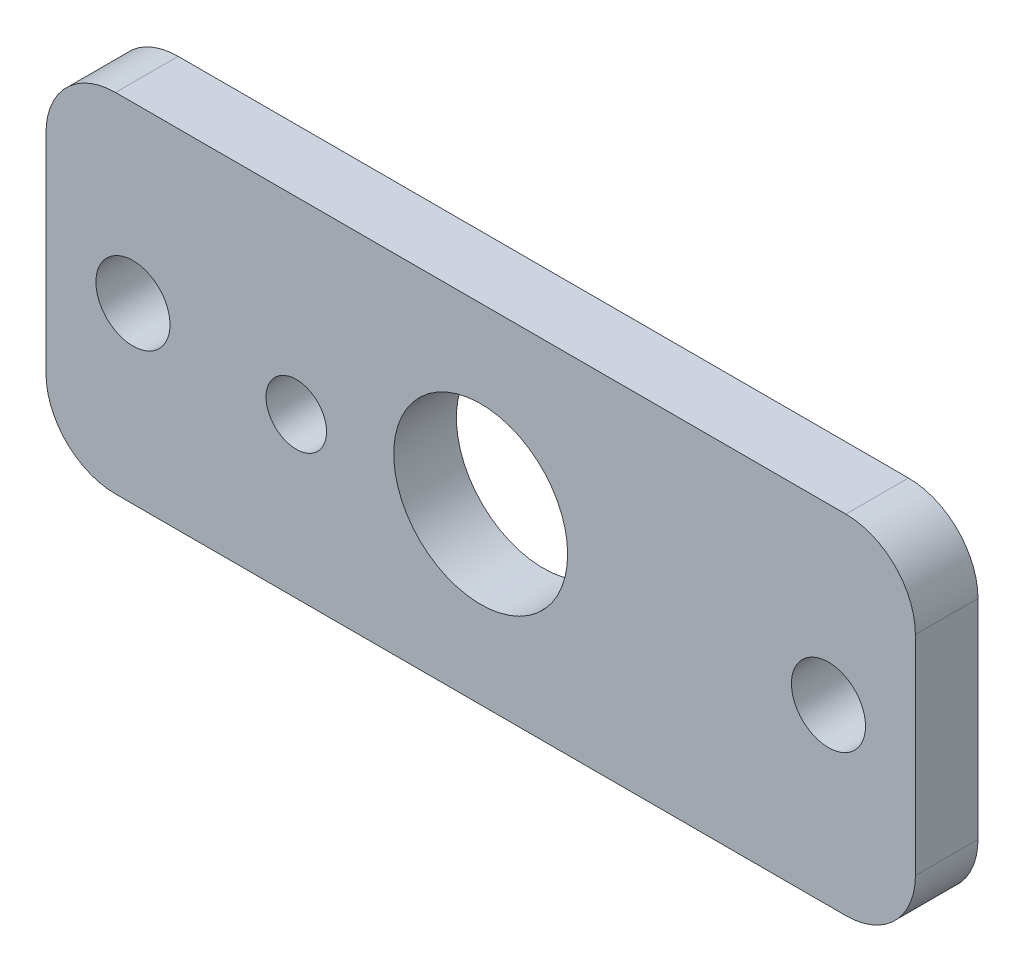
ISO-10303-21;
HEADER;
FILE_DESCRIPTION(('STEP AP214'),'2;1');
FILE_NAME('part.step','',(''),(''),'','','');
FILE_SCHEMA(('AUTOMOTIVE_DESIGN { 1 0 10303 214 1 1 1 1 }'));
ENDSEC;
DATA;
#1=APPLICATION_CONTEXT('core data for automotive mechanical design processes');
#2=APPLICATION_PROTOCOL_DEFINITION('international standard','automotive_design',2000,#1);
#3=PRODUCT_CONTEXT('',#1,'mechanical');
#4=PRODUCT('Part','Part','',(#3));
#5=PRODUCT_RELATED_PRODUCT_CATEGORY('part','',(#4));
#6=PRODUCT_DEFINITION_FORMATION('','',#4);
#7=PRODUCT_DEFINITION_CONTEXT('part definition',#1,'design');
#8=PRODUCT_DEFINITION('design','',#6,#7);
#9=PRODUCT_DEFINITION_SHAPE('','',#8);
#10=(LENGTH_UNIT() NAMED_UNIT(*) SI_UNIT(.MILLI.,.METRE.));
#11=(NAMED_UNIT(*) PLANE_ANGLE_UNIT() SI_UNIT($,.RADIAN.));
#12=(NAMED_UNIT(*) SI_UNIT($,.STERADIAN.) SOLID_ANGLE_UNIT());
#13=UNCERTAINTY_MEASURE_WITH_UNIT(LENGTH_MEASURE(1.E-05),#10,'distance_accuracy_value','');
#14=(GEOMETRIC_REPRESENTATION_CONTEXT(3) GLOBAL_UNCERTAINTY_ASSIGNED_CONTEXT((#13)) GLOBAL_UNIT_ASSIGNED_CONTEXT((#10,
#11,#12)) REPRESENTATION_CONTEXT('',''));
#15=CARTESIAN_POINT('',(0.,0.,0.));
#16=DIRECTION('',(0.,0.,1.));
#17=DIRECTION('',(1.,0.,0.));
#18=AXIS2_PLACEMENT_3D('',#15,#16,#17);
#19=CARTESIAN_POINT('',(15.8749998125921,-172.466000205086,2.2859999999977));
#20=DIRECTION('',(-1.,0.,0.));
#21=DIRECTION('',(0.,0.,1.));
#22=AXIS2_PLACEMENT_3D('',#19,#20,#21);
#23=PLANE('',#22);
#24=DIRECTION('',(0.,1.,0.));
#25=VECTOR('',#24,1.);
#26=CARTESIAN_POINT('',(15.8749998125921,-172.466000205086,2.2859999999977));
#27=LINE('',#26,#25);
#28=CARTESIAN_POINT('',(15.8749998125921,-169.926000205086,2.28599999999774));
#29=VERTEX_POINT('',#28);
#30=CARTESIAN_POINT('',(15.8749998125921,-162.306000205086,2.28599999999785));
#31=VERTEX_POINT('',#30);
#32=EDGE_CURVE('E122',#29,#31,#27,.T.);
#33=ORIENTED_EDGE('',*,*,#32,.F.);
#34=DIRECTION('',(0.,0.,-1.));
#35=VECTOR('',#34,1.);
#36=CARTESIAN_POINT('',(15.8749998125921,-169.926000205086,2.28599999999774));
#37=LINE('',#36,#35);
#38=CARTESIAN_POINT('',(15.8749998125921,-169.926000205086,-2.26034468919778E-12));
#39=VERTEX_POINT('',#38);
#40=EDGE_CURVE('E107',#29,#39,#37,.T.);
#41=ORIENTED_EDGE('',*,*,#40,.T.);
#42=DIRECTION('',(0.,1.,0.));
#43=VECTOR('',#42,1.);
#44=CARTESIAN_POINT('',(15.8749998125921,-172.466000205086,-2.29677388219329E-12));
#45=LINE('',#44,#43);
#46=CARTESIAN_POINT('',(15.8749998125921,-162.306000205086,-2.14585293978331E-12));
#47=VERTEX_POINT('',#46);
#48=EDGE_CURVE('E119',#39,#47,#45,.T.);
#49=ORIENTED_EDGE('',*,*,#48,.T.);
#50=DIRECTION('',(0.,0.,-1.));
#51=VECTOR('',#50,1.);
#52=CARTESIAN_POINT('',(15.8749998125921,-162.306000205086,2.28599999999785));
#53=LINE('',#52,#51);
#54=EDGE_CURVE('E124',#47,#31,#53,.F.);
#55=ORIENTED_EDGE('',*,*,#54,.T.);
#56=EDGE_LOOP('',(#33,#41,#49,#55));
#57=FACE_BOUND('',#56,.T.);
#58=ADVANCED_FACE('F36',(#57),#23,.F.);
#59=CARTESIAN_POINT('',(-15.875000187408,-159.766000205086,2.28599999999787));
#60=DIRECTION('',(0.,-1.,0.));
#61=DIRECTION('',(0.,0.,-1.));
#62=AXIS2_PLACEMENT_3D('',#59,#60,#61);
#63=PLANE('',#62);
#64=DIRECTION('',(-1.,0.,0.));
#65=VECTOR('',#64,1.);
#66=CARTESIAN_POINT('',(-15.875000187408,-159.766000205086,2.28599999999787));
#67=LINE('',#66,#65);
#68=CARTESIAN_POINT('',(13.3349998125922,-159.766000205086,2.28599999999787));
#69=VERTEX_POINT('',#68);
#70=CARTESIAN_POINT('',(-13.3350001874078,-159.766000205086,2.28599999999787));
#71=VERTEX_POINT('',#70);
#72=EDGE_CURVE('E166',#69,#71,#67,.T.);
#73=ORIENTED_EDGE('',*,*,#72,.F.);
#74=DIRECTION('',(0.,0.,-1.));
#75=VECTOR('',#74,1.);
#76=CARTESIAN_POINT('',(13.3349998125922,-159.766000205086,2.28599999999787));
#77=LINE('',#76,#75);
#78=CARTESIAN_POINT('',(13.3349998125921,-159.766000205086,-2.13717932240343E-12));
#79=VERTEX_POINT('',#78);
#80=EDGE_CURVE('E11',#69,#79,#77,.T.);
#81=ORIENTED_EDGE('',*,*,#80,.T.);
#82=DIRECTION('',(-1.,0.,0.));
#83=VECTOR('',#82,1.);
#84=CARTESIAN_POINT('',(-15.875000187408,-159.766000205086,-2.13717932240343E-12));
#85=LINE('',#84,#83);
#86=CARTESIAN_POINT('',(-13.3350001874079,-159.766000205086,-2.13717932240343E-12));
#87=VERTEX_POINT('',#86);
#88=EDGE_CURVE('E129',#79,#87,#85,.T.);
#89=ORIENTED_EDGE('',*,*,#88,.T.);
#90=DIRECTION('',(0.,0.,-1.));
#91=VECTOR('',#90,1.);
#92=CARTESIAN_POINT('',(-13.3350001874078,-159.766000205086,2.28599999999787));
#93=LINE('',#92,#91);
#94=EDGE_CURVE('E44',#87,#71,#93,.F.);
#95=ORIENTED_EDGE('',*,*,#94,.T.);
#96=EDGE_LOOP('',(#73,#81,#89,#95));
#97=FACE_BOUND('',#96,.T.);
#98=ADVANCED_FACE('F165',(#97),#63,.F.);
#99=CARTESIAN_POINT('',(-15.8750001874079,-172.466000205086,2.2859999999977));
#100=DIRECTION('',(1.,0.,0.));
#101=DIRECTION('',(0.,0.,-1.));
#102=AXIS2_PLACEMENT_3D('',#99,#100,#101);
#103=PLANE('',#102);
#104=DIRECTION('',(0.,-1.,0.));
#105=VECTOR('',#104,1.);
#106=CARTESIAN_POINT('',(-15.8750001874079,-172.466000205086,-2.33320307518881E-12));
#107=LINE('',#106,#105);
#108=CARTESIAN_POINT('',(-15.8750001874079,-162.306000205086,-2.17360851539894E-12));
#109=VERTEX_POINT('',#108);
#110=CARTESIAN_POINT('',(-15.875000187408,-169.926000205086,-2.26034468919778E-12));
#111=VERTEX_POINT('',#110);
#112=EDGE_CURVE('E133',#109,#111,#107,.T.);
#113=ORIENTED_EDGE('',*,*,#112,.T.);
#114=DIRECTION('',(0.,0.,-1.));
#115=VECTOR('',#114,1.);
#116=CARTESIAN_POINT('',(-15.875000187408,-169.926000205086,2.2859999999977));
#117=LINE('',#116,#115);
#118=CARTESIAN_POINT('',(-15.875000187408,-169.926000205086,2.2859999999977));
#119=VERTEX_POINT('',#118);
#120=EDGE_CURVE('E51',#111,#119,#117,.F.);
#121=ORIENTED_EDGE('',*,*,#120,.T.);
#122=DIRECTION('',(0.,-1.,0.));
#123=VECTOR('',#122,1.);
#124=CARTESIAN_POINT('',(-15.8750001874079,-172.466000205086,2.2859999999977));
#125=LINE('',#124,#123);
#126=CARTESIAN_POINT('',(-15.8750001874079,-162.306000205086,2.28599999999784));
#127=VERTEX_POINT('',#126);
#128=EDGE_CURVE('E172',#127,#119,#125,.T.);
#129=ORIENTED_EDGE('',*,*,#128,.F.);
#130=DIRECTION('',(0.,0.,-1.));
#131=VECTOR('',#130,1.);
#132=CARTESIAN_POINT('',(-15.8750001874079,-162.306000205086,2.28599999999784));
#133=LINE('',#132,#131);
#134=EDGE_CURVE('E159',#127,#109,#133,.T.);
#135=ORIENTED_EDGE('',*,*,#134,.T.);
#136=EDGE_LOOP('',(#113,#121,#129,#135));
#137=FACE_BOUND('',#136,.T.);
#138=ADVANCED_FACE('F176',(#137),#103,.F.);
#139=CARTESIAN_POINT('',(-15.8750001874079,-172.466000205086,2.2859999999977));
#140=DIRECTION('',(0.,1.,0.));
#141=DIRECTION('',(0.,0.,1.));
#142=AXIS2_PLACEMENT_3D('',#139,#140,#141);
#143=PLANE('',#142);
#144=DIRECTION('',(1.,0.,0.));
#145=VECTOR('',#144,1.);
#146=CARTESIAN_POINT('',(-15.8750001874079,-172.466000205086,-2.33320307518881E-12));
#147=LINE('',#146,#145);
#148=CARTESIAN_POINT('',(-13.3350001874079,-172.466000205086,-2.29677388219329E-12));
#149=VERTEX_POINT('',#148);
#150=CARTESIAN_POINT('',(13.3349998125921,-172.466000205086,-2.29677388219329E-12));
#151=VERTEX_POINT('',#150);
#152=EDGE_CURVE('E143',#149,#151,#147,.T.);
#153=ORIENTED_EDGE('',*,*,#152,.T.);
#154=DIRECTION('',(0.,0.,-1.));
#155=VECTOR('',#154,1.);
#156=CARTESIAN_POINT('',(13.3349998125922,-172.466000205086,2.2859999999977));
#157=LINE('',#156,#155);
#158=CARTESIAN_POINT('',(13.3349998125922,-172.466000205086,2.2859999999977));
#159=VERTEX_POINT('',#158);
#160=EDGE_CURVE('E108',#151,#159,#157,.F.);
#161=ORIENTED_EDGE('',*,*,#160,.T.);
#162=DIRECTION('',(1.,0.,0.));
#163=VECTOR('',#162,1.);
#164=CARTESIAN_POINT('',(-15.8750001874079,-172.466000205086,2.2859999999977));
#165=LINE('',#164,#163);
#166=CARTESIAN_POINT('',(-13.3350001874078,-172.466000205086,2.2859999999977));
#167=VERTEX_POINT('',#166);
#168=EDGE_CURVE('E139',#167,#159,#165,.T.);
#169=ORIENTED_EDGE('',*,*,#168,.F.);
#170=DIRECTION('',(0.,0.,-1.));
#171=VECTOR('',#170,1.);
#172=CARTESIAN_POINT('',(-13.3350001874078,-172.466000205086,2.2859999999977));
#173=LINE('',#172,#171);
#174=EDGE_CURVE('E113',#167,#149,#173,.T.);
#175=ORIENTED_EDGE('',*,*,#174,.T.);
#176=EDGE_LOOP('',(#153,#161,#169,#175));
#177=FACE_BOUND('',#176,.T.);
#178=ADVANCED_FACE('F183',(#177),#143,.F.);
#179=CARTESIAN_POINT('',(0.,0.,2.286));
#180=DIRECTION('',(0.,0.,-1.));
#181=DIRECTION('',(-1.,0.,0.));
#182=AXIS2_PLACEMENT_3D('',#179,#180,#181);
#183=PLANE('',#182);
#184=CARTESIAN_POINT('',(12.6999999062961,-166.116000205086,2.2859999999978));
#185=DIRECTION('',(0.,0.,1.));
#186=DIRECTION('',(1.,0.,0.));
#187=AXIS2_PLACEMENT_3D('',#184,#185,#186);
#188=CIRCLE('',#187,1.35254999999999);
#189=CARTESIAN_POINT('',(14.052549906296,-166.116000205086,2.2859999999978));
#190=VERTEX_POINT('',#189);
#191=EDGE_CURVE('E203',#190,#190,#188,.T.);
#192=ORIENTED_EDGE('',*,*,#191,.F.);
#193=EDGE_LOOP('',(#192));
#194=FACE_BOUND('',#193,.T.);
#195=CARTESIAN_POINT('',(-12.7000000937039,-166.116000205086,2.2859999999978));
#196=DIRECTION('',(0.,0.,1.));
#197=DIRECTION('',(1.,0.,0.));
#198=AXIS2_PLACEMENT_3D('',#195,#196,#197);
#199=CIRCLE('',#198,1.35254999999999);
#200=CARTESIAN_POINT('',(-11.347450093704,-166.116000205086,2.2859999999978));
#201=VERTEX_POINT('',#200);
#202=EDGE_CURVE('E197',#201,#201,#199,.T.);
#203=ORIENTED_EDGE('',*,*,#202,.F.);
#204=EDGE_LOOP('',(#203));
#205=FACE_BOUND('',#204,.T.);
#206=CARTESIAN_POINT('',(-6.7355724712014,-166.646101110379,2.2859999999978));
#207=DIRECTION('',(0.,0.,1.));
#208=DIRECTION('',(1.,0.,0.));
#209=AXIS2_PLACEMENT_3D('',#206,#207,#208);
#210=CIRCLE('',#209,1.1049);
#211=CARTESIAN_POINT('',(-5.6306724712014,-166.646101110379,2.2859999999978));
#212=VERTEX_POINT('',#211);
#213=EDGE_CURVE('E189',#212,#212,#210,.T.);
#214=ORIENTED_EDGE('',*,*,#213,.F.);
#215=EDGE_LOOP('',(#214));
#216=FACE_BOUND('',#215,.T.);
#217=CARTESIAN_POINT('',(-1.87407885969092E-07,-166.116000205086,2.2859999999978));
#218=DIRECTION('',(0.,0.,1.));
#219=DIRECTION('',(1.,0.,0.));
#220=AXIS2_PLACEMENT_3D('',#217,#218,#219);
#221=CIRCLE('',#220,3.175);
#222=CARTESIAN_POINT('',(3.17499981259211,-166.116000205086,2.2859999999978));
#223=VERTEX_POINT('',#222);
#224=EDGE_CURVE('E136',#223,#223,#221,.T.);
#225=ORIENTED_EDGE('',*,*,#224,.F.);
#226=EDGE_LOOP('',(#225));
#227=FACE_BOUND('',#226,.T.);
#228=ORIENTED_EDGE('',*,*,#168,.T.);
#229=CARTESIAN_POINT('',(13.3349998125922,-169.926000205086,2.28599999999774));
#230=DIRECTION('',(0.,0.,-1.));
#231=DIRECTION('',(-1.,0.,0.));
#232=AXIS2_PLACEMENT_3D('',#229,#230,#231);
#233=CIRCLE('',#232,2.54);
#234=EDGE_CURVE('E157',#159,#29,#233,.F.);
#235=ORIENTED_EDGE('',*,*,#234,.T.);
#236=ORIENTED_EDGE('',*,*,#32,.T.);
#237=CARTESIAN_POINT('',(13.3349998125922,-162.306000205086,2.28599999999785));
#238=DIRECTION('',(0.,0.,-1.));
#239=DIRECTION('',(-1.,0.,0.));
#240=AXIS2_PLACEMENT_3D('',#237,#238,#239);
#241=CIRCLE('',#240,2.54);
#242=EDGE_CURVE('E153',#31,#69,#241,.F.);
#243=ORIENTED_EDGE('',*,*,#242,.T.);
#244=ORIENTED_EDGE('',*,*,#72,.T.);
#245=CARTESIAN_POINT('',(-13.3350001874078,-162.306000205086,2.28599999999784));
#246=DIRECTION('',(0.,0.,-1.));
#247=DIRECTION('',(-1.,0.,0.));
#248=AXIS2_PLACEMENT_3D('',#245,#246,#247);
#249=CIRCLE('',#248,2.54);
#250=EDGE_CURVE('E58',#71,#127,#249,.F.);
#251=ORIENTED_EDGE('',*,*,#250,.T.);
#252=ORIENTED_EDGE('',*,*,#128,.T.);
#253=CARTESIAN_POINT('',(-13.3350001874078,-169.926000205086,2.28599999999774));
#254=DIRECTION('',(0.,0.,-1.));
#255=DIRECTION('',(-1.,0.,0.));
#256=AXIS2_PLACEMENT_3D('',#253,#254,#255);
#257=CIRCLE('',#256,2.54);
#258=EDGE_CURVE('E155',#119,#167,#257,.F.);
#259=ORIENTED_EDGE('',*,*,#258,.T.);
#260=EDGE_LOOP('',(#228,#235,#236,#243,#244,#251,#252,#259));
#261=FACE_BOUND('',#260,.T.);
#262=ADVANCED_FACE('F170',(#194,#205,#216,#227,#261),#183,.F.);
#263=CARTESIAN_POINT('',(0.,0.,0.));
#264=DIRECTION('',(0.,0.,-1.));
#265=DIRECTION('',(-1.,0.,0.));
#266=AXIS2_PLACEMENT_3D('',#263,#264,#265);
#267=PLANE('',#266);
#268=CARTESIAN_POINT('',(12.699999906296,-166.116000205086,-2.19615992058664E-12));
#269=DIRECTION('',(0.,0.,1.));
#270=DIRECTION('',(1.,0.,0.));
#271=AXIS2_PLACEMENT_3D('',#268,#269,#270);
#272=CIRCLE('',#271,1.35255);
#273=CARTESIAN_POINT('',(14.052549906296,-166.116000205086,-2.19615992059176E-12));
#274=VERTEX_POINT('',#273);
#275=EDGE_CURVE('E200',#274,#274,#272,.T.);
#276=ORIENTED_EDGE('',*,*,#275,.T.);
#277=EDGE_LOOP('',(#276));
#278=FACE_BOUND('',#277,.T.);
#279=CARTESIAN_POINT('',(-12.700000093704,-166.116000205086,-2.19615992058664E-12));
#280=DIRECTION('',(0.,0.,1.));
#281=DIRECTION('',(1.,0.,0.));
#282=AXIS2_PLACEMENT_3D('',#279,#280,#281);
#283=CIRCLE('',#282,1.35255);
#284=CARTESIAN_POINT('',(-11.347450093704,-166.116000205086,-2.19615992059176E-12));
#285=VERTEX_POINT('',#284);
#286=EDGE_CURVE('E192',#285,#285,#283,.T.);
#287=ORIENTED_EDGE('',*,*,#286,.T.);
#288=EDGE_LOOP('',(#287));
#289=FACE_BOUND('',#288,.T.);
#290=CARTESIAN_POINT('',(-6.7355724712014,-166.646101110379,-2.19615992058664E-12));
#291=DIRECTION('',(0.,0.,1.));
#292=DIRECTION('',(1.,0.,0.));
#293=AXIS2_PLACEMENT_3D('',#290,#291,#292);
#294=CIRCLE('',#293,1.1049);
#295=CARTESIAN_POINT('',(-5.6306724712014,-166.646101110379,-2.19615992059082E-12));
#296=VERTEX_POINT('',#295);
#297=EDGE_CURVE('E187',#296,#296,#294,.T.);
#298=ORIENTED_EDGE('',*,*,#297,.T.);
#299=EDGE_LOOP('',(#298));
#300=FACE_BOUND('',#299,.T.);
#301=CARTESIAN_POINT('',(-1.87407885969092E-07,-166.116000205086,-2.19615992058664E-12));
#302=DIRECTION('',(0.,0.,1.));
#303=DIRECTION('',(1.,0.,0.));
#304=AXIS2_PLACEMENT_3D('',#301,#302,#303);
#305=CIRCLE('',#304,3.175);
#306=CARTESIAN_POINT('',(3.17499981259211,-166.116000205086,-2.19615992059866E-12));
#307=VERTEX_POINT('',#306);
#308=EDGE_CURVE('E130',#307,#307,#305,.T.);
#309=ORIENTED_EDGE('',*,*,#308,.T.);
#310=EDGE_LOOP('',(#309));
#311=FACE_BOUND('',#310,.T.);
#312=ORIENTED_EDGE('',*,*,#48,.F.);
#313=CARTESIAN_POINT('',(13.3349998125921,-169.926000205086,-2.26034468919778E-12));
#314=DIRECTION('',(0.,0.,-1.));
#315=DIRECTION('',(-1.,0.,0.));
#316=AXIS2_PLACEMENT_3D('',#313,#314,#315);
#317=CIRCLE('',#316,2.54);
#318=EDGE_CURVE('E103',#39,#151,#317,.T.);
#319=ORIENTED_EDGE('',*,*,#318,.T.);
#320=ORIENTED_EDGE('',*,*,#152,.F.);
#321=CARTESIAN_POINT('',(-13.3350001874079,-169.926000205086,-2.26034468919778E-12));
#322=DIRECTION('',(0.,0.,-1.));
#323=DIRECTION('',(-1.,0.,0.));
#324=AXIS2_PLACEMENT_3D('',#321,#322,#323);
#325=CIRCLE('',#324,2.54);
#326=EDGE_CURVE('E114',#149,#111,#325,.T.);
#327=ORIENTED_EDGE('',*,*,#326,.T.);
#328=ORIENTED_EDGE('',*,*,#112,.F.);
#329=CARTESIAN_POINT('',(-13.3350001874079,-162.306000205086,-2.17360851539894E-12));
#330=DIRECTION('',(0.,0.,-1.));
#331=DIRECTION('',(-1.,0.,0.));
#332=AXIS2_PLACEMENT_3D('',#329,#330,#331);
#333=CIRCLE('',#332,2.54);
#334=EDGE_CURVE('E123',#109,#87,#333,.T.);
#335=ORIENTED_EDGE('',*,*,#334,.T.);
#336=ORIENTED_EDGE('',*,*,#88,.F.);
#337=CARTESIAN_POINT('',(13.3349998125921,-162.306000205086,-2.15973072759112E-12));
#338=DIRECTION('',(0.,0.,-1.));
#339=DIRECTION('',(-1.,0.,0.));
#340=AXIS2_PLACEMENT_3D('',#337,#338,#339);
#341=CIRCLE('',#340,2.54);
#342=EDGE_CURVE('E128',#79,#47,#341,.T.);
#343=ORIENTED_EDGE('',*,*,#342,.T.);
#344=EDGE_LOOP('',(#312,#319,#320,#327,#328,#335,#336,#343));
#345=FACE_BOUND('',#344,.T.);
#346=ADVANCED_FACE('F126',(#278,#289,#300,#311,#345),#267,.T.);
#347=CARTESIAN_POINT('',(13.3349998125922,-169.926000205086,2.28599999999774));
#348=DIRECTION('',(0.,0.,-1.));
#349=DIRECTION('',(-1.,0.,0.));
#350=AXIS2_PLACEMENT_3D('',#347,#348,#349);
#351=CYLINDRICAL_SURFACE('',#350,2.54);
#352=ORIENTED_EDGE('',*,*,#234,.F.);
#353=ORIENTED_EDGE('',*,*,#160,.F.);
#354=ORIENTED_EDGE('',*,*,#318,.F.);
#355=ORIENTED_EDGE('',*,*,#40,.F.);
#356=EDGE_LOOP('',(#352,#353,#354,#355));
#357=FACE_BOUND('',#356,.T.);
#358=ADVANCED_FACE('F106',(#357),#351,.T.);
#359=CARTESIAN_POINT('',(-13.3350001874078,-169.926000205086,2.28599999999774));
#360=DIRECTION('',(0.,0.,-1.));
#361=DIRECTION('',(-1.,0.,0.));
#362=AXIS2_PLACEMENT_3D('',#359,#360,#361);
#363=CYLINDRICAL_SURFACE('',#362,2.54);
#364=ORIENTED_EDGE('',*,*,#258,.F.);
#365=ORIENTED_EDGE('',*,*,#120,.F.);
#366=ORIENTED_EDGE('',*,*,#326,.F.);
#367=ORIENTED_EDGE('',*,*,#174,.F.);
#368=EDGE_LOOP('',(#364,#365,#366,#367));
#369=FACE_BOUND('',#368,.T.);
#370=ADVANCED_FACE('F180',(#369),#363,.T.);
#371=CARTESIAN_POINT('',(13.3349998125922,-162.306000205086,2.28599999999785));
#372=DIRECTION('',(0.,0.,-1.));
#373=DIRECTION('',(-1.,0.,0.));
#374=AXIS2_PLACEMENT_3D('',#371,#372,#373);
#375=CYLINDRICAL_SURFACE('',#374,2.54);
#376=ORIENTED_EDGE('',*,*,#242,.F.);
#377=ORIENTED_EDGE('',*,*,#54,.F.);
#378=ORIENTED_EDGE('',*,*,#342,.F.);
#379=ORIENTED_EDGE('',*,*,#80,.F.);
#380=EDGE_LOOP('',(#376,#377,#378,#379));
#381=FACE_BOUND('',#380,.T.);
#382=ADVANCED_FACE('F230',(#381),#375,.T.);
#383=CARTESIAN_POINT('',(-13.3350001874078,-162.306000205086,2.28599999999784));
#384=DIRECTION('',(0.,0.,-1.));
#385=DIRECTION('',(-1.,0.,0.));
#386=AXIS2_PLACEMENT_3D('',#383,#384,#385);
#387=CYLINDRICAL_SURFACE('',#386,2.54);
#388=ORIENTED_EDGE('',*,*,#250,.F.);
#389=ORIENTED_EDGE('',*,*,#94,.F.);
#390=ORIENTED_EDGE('',*,*,#334,.F.);
#391=ORIENTED_EDGE('',*,*,#134,.F.);
#392=EDGE_LOOP('',(#388,#389,#390,#391));
#393=FACE_BOUND('',#392,.T.);
#394=ADVANCED_FACE('F38',(#393),#387,.T.);
#395=CARTESIAN_POINT('',(-1.87407885969092E-07,-166.116000205086,-2.19615992058664E-12));
#396=DIRECTION('',(0.,0.,1.));
#397=DIRECTION('',(1.,0.,0.));
#398=AXIS2_PLACEMENT_3D('',#395,#396,#397);
#399=CYLINDRICAL_SURFACE('',#398,3.175);
#400=ORIENTED_EDGE('',*,*,#308,.F.);
#401=EDGE_LOOP('',(#400));
#402=FACE_BOUND('',#401,.T.);
#403=ORIENTED_EDGE('',*,*,#224,.T.);
#404=EDGE_LOOP('',(#403));
#405=FACE_BOUND('',#404,.T.);
#406=ADVANCED_FACE('F218',(#402,#405),#399,.F.);
#407=CARTESIAN_POINT('',(-6.7355724712014,-166.646101110379,-2.19615992058664E-12));
#408=DIRECTION('',(0.,0.,1.));
#409=DIRECTION('',(1.,0.,0.));
#410=AXIS2_PLACEMENT_3D('',#407,#408,#409);
#411=CYLINDRICAL_SURFACE('',#410,1.1049);
#412=ORIENTED_EDGE('',*,*,#297,.F.);
#413=EDGE_LOOP('',(#412));
#414=FACE_BOUND('',#413,.T.);
#415=ORIENTED_EDGE('',*,*,#213,.T.);
#416=EDGE_LOOP('',(#415));
#417=FACE_BOUND('',#416,.T.);
#418=ADVANCED_FACE('F220',(#414,#417),#411,.F.);
#419=CARTESIAN_POINT('',(-12.7000000937039,-166.116000205086,2.2859999999978));
#420=DIRECTION('',(0.,0.,1.));
#421=DIRECTION('',(1.,0.,0.));
#422=AXIS2_PLACEMENT_3D('',#419,#420,#421);
#423=CYLINDRICAL_SURFACE('',#422,1.35254999999999);
#424=ORIENTED_EDGE('',*,*,#286,.F.);
#425=EDGE_LOOP('',(#424));
#426=FACE_BOUND('',#425,.T.);
#427=ORIENTED_EDGE('',*,*,#202,.T.);
#428=EDGE_LOOP('',(#427));
#429=FACE_BOUND('',#428,.T.);
#430=ADVANCED_FACE('F227',(#426,#429),#423,.F.);
#431=CARTESIAN_POINT('',(12.6999999062961,-166.116000205086,2.2859999999978));
#432=DIRECTION('',(0.,0.,1.));
#433=DIRECTION('',(1.,0.,0.));
#434=AXIS2_PLACEMENT_3D('',#431,#432,#433);
#435=CYLINDRICAL_SURFACE('',#434,1.35254999999999);
#436=ORIENTED_EDGE('',*,*,#275,.F.);
#437=EDGE_LOOP('',(#436));
#438=FACE_BOUND('',#437,.T.);
#439=ORIENTED_EDGE('',*,*,#191,.T.);
#440=EDGE_LOOP('',(#439));
#441=FACE_BOUND('',#440,.T.);
#442=ADVANCED_FACE('F207',(#438,#441),#435,.F.);
#443=CLOSED_SHELL('',(#58,#98,#138,#178,#262,#346,#358,#370,#382,#394,#406,#418,#430,#442));
#444=MANIFOLD_SOLID_BREP('B2',#443);
#445=ADVANCED_BREP_SHAPE_REPRESENTATION('',(#18,#444),#14);
#446=SHAPE_DEFINITION_REPRESENTATION(#9,#445);
ENDSEC;
END-ISO-10303-21;
